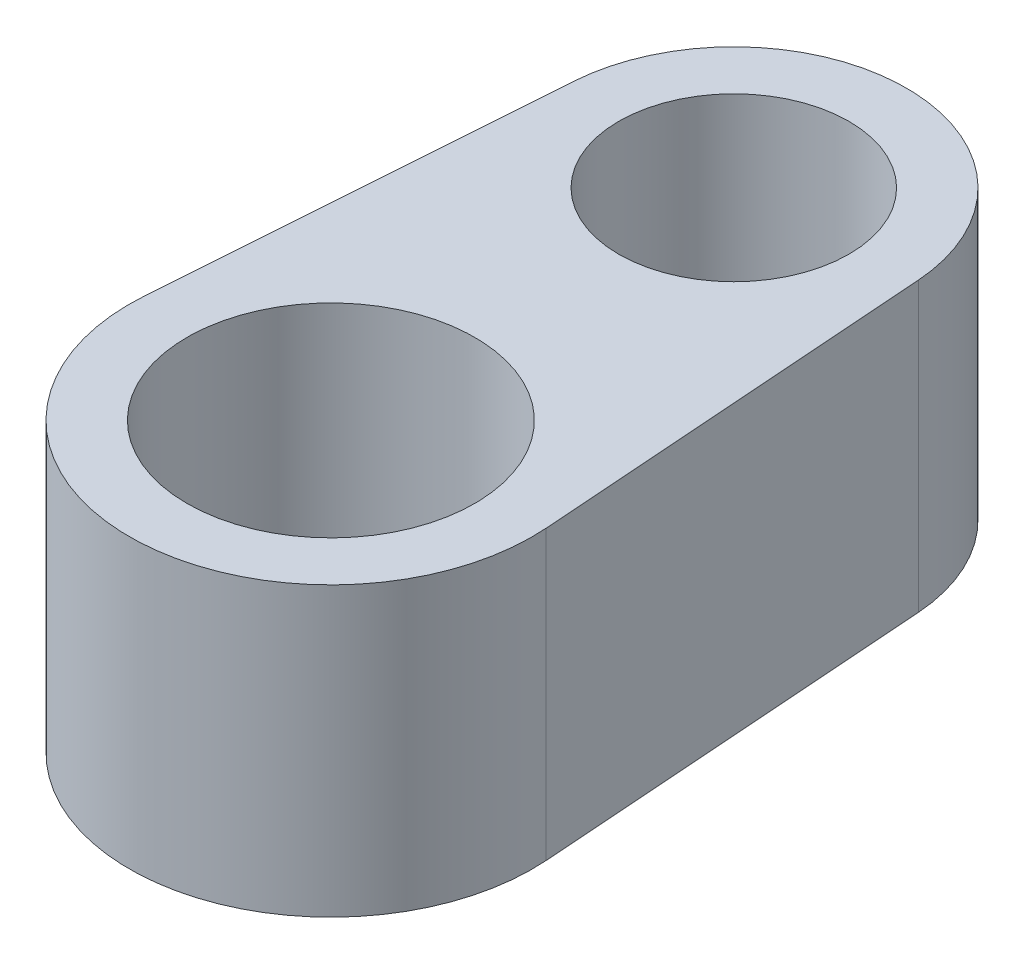
ISO-10303-21;
HEADER;
FILE_DESCRIPTION(('STEP AP214'),'2;1');
FILE_NAME('part.step','',(''),(''),'','','');
FILE_SCHEMA(('AUTOMOTIVE_DESIGN { 1 0 10303 214 1 1 1 1 }'));
ENDSEC;
DATA;
#1=APPLICATION_CONTEXT('core data for automotive mechanical design processes');
#2=APPLICATION_PROTOCOL_DEFINITION('international standard','automotive_design',2000,#1);
#3=PRODUCT_CONTEXT('',#1,'mechanical');
#4=PRODUCT('Part','Part','',(#3));
#5=PRODUCT_RELATED_PRODUCT_CATEGORY('part','',(#4));
#6=PRODUCT_DEFINITION_FORMATION('','',#4);
#7=PRODUCT_DEFINITION_CONTEXT('part definition',#1,'design');
#8=PRODUCT_DEFINITION('design','',#6,#7);
#9=PRODUCT_DEFINITION_SHAPE('','',#8);
#10=(LENGTH_UNIT() NAMED_UNIT(*) SI_UNIT(.MILLI.,.METRE.));
#11=(NAMED_UNIT(*) PLANE_ANGLE_UNIT() SI_UNIT($,.RADIAN.));
#12=(NAMED_UNIT(*) SI_UNIT($,.STERADIAN.) SOLID_ANGLE_UNIT());
#13=UNCERTAINTY_MEASURE_WITH_UNIT(LENGTH_MEASURE(1.E-05),#10,'distance_accuracy_value','');
#14=(GEOMETRIC_REPRESENTATION_CONTEXT(3) GLOBAL_UNCERTAINTY_ASSIGNED_CONTEXT((#13)) GLOBAL_UNIT_ASSIGNED_CONTEXT((#10,
#11,#12)) REPRESENTATION_CONTEXT('',''));
#15=CARTESIAN_POINT('',(0.,0.,0.));
#16=DIRECTION('',(0.,0.,1.));
#17=DIRECTION('',(1.,0.,0.));
#18=AXIS2_PLACEMENT_3D('',#15,#16,#17);
#19=CARTESIAN_POINT('',(0.,6.35,-8.89));
#20=DIRECTION('',(0.,-1.,0.));
#21=DIRECTION('',(0.,0.,-1.));
#22=AXIS2_PLACEMENT_3D('',#19,#20,#21);
#23=CYLINDRICAL_SURFACE('',#22,3.81);
#24=CARTESIAN_POINT('',(0.,0.,-8.89));
#25=DIRECTION('',(0.,1.,0.));
#26=DIRECTION('',(0.,0.,1.));
#27=AXIS2_PLACEMENT_3D('',#24,#25,#26);
#28=CIRCLE('',#27,3.81);
#29=CARTESIAN_POINT('',(3.80026818333998,0.,-9.16214285714285));
#30=VERTEX_POINT('',#29);
#31=CARTESIAN_POINT('',(-3.80026818333998,0.,-9.16214285714285));
#32=VERTEX_POINT('',#31);
#33=EDGE_CURVE('E105',#30,#32,#28,.T.);
#34=ORIENTED_EDGE('',*,*,#33,.T.);
#35=DIRECTION('',(0.,-1.,0.));
#36=VECTOR('',#35,1.);
#37=CARTESIAN_POINT('',(-3.80026818333998,6.35,-9.16214285714285));
#38=LINE('',#37,#36);
#39=CARTESIAN_POINT('',(-3.80026818333998,6.35,-9.16214285714285));
#40=VERTEX_POINT('',#39);
#41=EDGE_CURVE('E11',#40,#32,#38,.T.);
#42=ORIENTED_EDGE('',*,*,#41,.F.);
#43=CARTESIAN_POINT('',(0.,6.35,-8.89));
#44=DIRECTION('',(0.,1.,0.));
#45=DIRECTION('',(0.,0.,1.));
#46=AXIS2_PLACEMENT_3D('',#43,#44,#45);
#47=CIRCLE('',#46,3.81);
#48=CARTESIAN_POINT('',(3.80026818333998,6.35,-9.16214285714285));
#49=VERTEX_POINT('',#48);
#50=EDGE_CURVE('E85',#49,#40,#47,.T.);
#51=ORIENTED_EDGE('',*,*,#50,.F.);
#52=DIRECTION('',(0.,-1.,0.));
#53=VECTOR('',#52,1.);
#54=CARTESIAN_POINT('',(3.80026818333998,6.35,-9.16214285714285));
#55=LINE('',#54,#53);
#56=EDGE_CURVE('E51',#49,#30,#55,.T.);
#57=ORIENTED_EDGE('',*,*,#56,.T.);
#58=EDGE_LOOP('',(#34,#42,#51,#57));
#59=FACE_BOUND('',#58,.T.);
#60=ADVANCED_FACE('F35',(#59),#23,.T.);
#61=CARTESIAN_POINT('',(-4.43364621389664,6.35,-0.317499999999999));
#62=DIRECTION('',(0.997445717412067,0.,0.0714285714285713));
#63=DIRECTION('',(0.0714285714285713,0.,-0.997445717412067));
#64=AXIS2_PLACEMENT_3D('',#61,#62,#63);
#65=PLANE('',#64);
#66=DIRECTION('',(-0.0714285714285713,0.,0.997445717412067));
#67=VECTOR('',#66,1.);
#68=CARTESIAN_POINT('',(-4.43364621389664,0.,-0.317499999999999));
#69=LINE('',#68,#67);
#70=CARTESIAN_POINT('',(-4.43364621389664,0.,-0.3175));
#71=VERTEX_POINT('',#70);
#72=EDGE_CURVE('E90',#32,#71,#69,.T.);
#73=ORIENTED_EDGE('',*,*,#72,.T.);
#74=DIRECTION('',(0.,-1.,0.));
#75=VECTOR('',#74,1.);
#76=CARTESIAN_POINT('',(-4.43364621389664,6.35,-0.3175));
#77=LINE('',#76,#75);
#78=CARTESIAN_POINT('',(-4.43364621389664,6.35,-0.3175));
#79=VERTEX_POINT('',#78);
#80=EDGE_CURVE('E43',#79,#71,#77,.T.);
#81=ORIENTED_EDGE('',*,*,#80,.F.);
#82=DIRECTION('',(-0.0714285714285713,0.,0.997445717412067));
#83=VECTOR('',#82,1.);
#84=CARTESIAN_POINT('',(-4.43364621389664,6.35,-0.317499999999999));
#85=LINE('',#84,#83);
#86=EDGE_CURVE('E77',#40,#79,#85,.T.);
#87=ORIENTED_EDGE('',*,*,#86,.F.);
#88=ORIENTED_EDGE('',*,*,#41,.T.);
#89=EDGE_LOOP('',(#73,#81,#87,#88));
#90=FACE_BOUND('',#89,.T.);
#91=ADVANCED_FACE('F89',(#90),#65,.F.);
#92=CARTESIAN_POINT('',(0.,6.35,0.));
#93=DIRECTION('',(0.,-1.,0.));
#94=DIRECTION('',(0.,0.,-1.));
#95=AXIS2_PLACEMENT_3D('',#92,#93,#94);
#96=CYLINDRICAL_SURFACE('',#95,4.445);
#97=CARTESIAN_POINT('',(0.,0.,0.));
#98=DIRECTION('',(0.,1.,0.));
#99=DIRECTION('',(0.,0.,1.));
#100=AXIS2_PLACEMENT_3D('',#97,#98,#99);
#101=CIRCLE('',#100,4.445);
#102=CARTESIAN_POINT('',(4.43364621389664,0.,-0.3175));
#103=VERTEX_POINT('',#102);
#104=EDGE_CURVE('E108',#71,#103,#101,.T.);
#105=ORIENTED_EDGE('',*,*,#104,.T.);
#106=DIRECTION('',(0.,-1.,0.));
#107=VECTOR('',#106,1.);
#108=CARTESIAN_POINT('',(4.43364621389664,6.35,-0.3175));
#109=LINE('',#108,#107);
#110=CARTESIAN_POINT('',(4.43364621389664,6.35,-0.3175));
#111=VERTEX_POINT('',#110);
#112=EDGE_CURVE('E66',#111,#103,#109,.T.);
#113=ORIENTED_EDGE('',*,*,#112,.F.);
#114=CARTESIAN_POINT('',(0.,6.35,0.));
#115=DIRECTION('',(0.,1.,0.));
#116=DIRECTION('',(0.,0.,1.));
#117=AXIS2_PLACEMENT_3D('',#114,#115,#116);
#118=CIRCLE('',#117,4.445);
#119=EDGE_CURVE('E84',#79,#111,#118,.T.);
#120=ORIENTED_EDGE('',*,*,#119,.F.);
#121=ORIENTED_EDGE('',*,*,#80,.T.);
#122=EDGE_LOOP('',(#105,#113,#120,#121));
#123=FACE_BOUND('',#122,.T.);
#124=ADVANCED_FACE('F93',(#123),#96,.T.);
#125=CARTESIAN_POINT('',(0.,6.35,0.));
#126=DIRECTION('',(0.,-1.,0.));
#127=DIRECTION('',(0.,0.,-1.));
#128=AXIS2_PLACEMENT_3D('',#125,#126,#127);
#129=CYLINDRICAL_SURFACE('',#128,3.175);
#130=CARTESIAN_POINT('',(0.,6.35,0.));
#131=DIRECTION('',(0.,1.,0.));
#132=DIRECTION('',(0.,0.,1.));
#133=AXIS2_PLACEMENT_3D('',#130,#131,#132);
#134=CIRCLE('',#133,3.175);
#135=CARTESIAN_POINT('',(0.,6.35,3.175));
#136=VERTEX_POINT('',#135);
#137=EDGE_CURVE('E96',#136,#136,#134,.T.);
#138=ORIENTED_EDGE('',*,*,#137,.T.);
#139=EDGE_LOOP('',(#138));
#140=FACE_BOUND('',#139,.T.);
#141=CARTESIAN_POINT('',(0.,0.,0.));
#142=DIRECTION('',(0.,1.,0.));
#143=DIRECTION('',(0.,0.,1.));
#144=AXIS2_PLACEMENT_3D('',#141,#142,#143);
#145=CIRCLE('',#144,3.175);
#146=CARTESIAN_POINT('',(0.,0.,3.175));
#147=VERTEX_POINT('',#146);
#148=EDGE_CURVE('E113',#147,#147,#145,.T.);
#149=ORIENTED_EDGE('',*,*,#148,.F.);
#150=EDGE_LOOP('',(#149));
#151=FACE_BOUND('',#150,.T.);
#152=ADVANCED_FACE('F134',(#140,#151),#129,.F.);
#153=CARTESIAN_POINT('',(4.43364621389664,6.35,-0.3175));
#154=DIRECTION('',(0.997445717412067,0.,-0.0714285714285714));
#155=DIRECTION('',(-0.0714285714285714,0.,-0.997445717412067));
#156=AXIS2_PLACEMENT_3D('',#153,#154,#155);
#157=PLANE('',#156);
#158=DIRECTION('',(0.0714285714285714,0.,0.997445717412067));
#159=VECTOR('',#158,1.);
#160=CARTESIAN_POINT('',(4.43364621389664,0.,-0.3175));
#161=LINE('',#160,#159);
#162=EDGE_CURVE('E110',#30,#103,#161,.T.);
#163=ORIENTED_EDGE('',*,*,#162,.F.);
#164=ORIENTED_EDGE('',*,*,#56,.F.);
#165=DIRECTION('',(0.0714285714285714,0.,0.997445717412067));
#166=VECTOR('',#165,1.);
#167=CARTESIAN_POINT('',(4.43364621389664,6.35,-0.3175));
#168=LINE('',#167,#166);
#169=EDGE_CURVE('E94',#49,#111,#168,.T.);
#170=ORIENTED_EDGE('',*,*,#169,.T.);
#171=ORIENTED_EDGE('',*,*,#112,.T.);
#172=EDGE_LOOP('',(#163,#164,#170,#171));
#173=FACE_BOUND('',#172,.T.);
#174=ADVANCED_FACE('F126',(#173),#157,.T.);
#175=CARTESIAN_POINT('',(0.,6.35,-8.89));
#176=DIRECTION('',(0.,-1.,0.));
#177=DIRECTION('',(0.,0.,-1.));
#178=AXIS2_PLACEMENT_3D('',#175,#176,#177);
#179=CYLINDRICAL_SURFACE('',#178,2.54);
#180=CARTESIAN_POINT('',(0.,6.35,-8.89));
#181=DIRECTION('',(0.,1.,0.));
#182=DIRECTION('',(0.,0.,1.));
#183=AXIS2_PLACEMENT_3D('',#180,#181,#182);
#184=CIRCLE('',#183,2.54);
#185=CARTESIAN_POINT('',(0.,6.35,-6.35));
#186=VERTEX_POINT('',#185);
#187=EDGE_CURVE('E102',#186,#186,#184,.T.);
#188=ORIENTED_EDGE('',*,*,#187,.T.);
#189=EDGE_LOOP('',(#188));
#190=FACE_BOUND('',#189,.T.);
#191=CARTESIAN_POINT('',(0.,0.,-8.89));
#192=DIRECTION('',(0.,1.,0.));
#193=DIRECTION('',(0.,0.,1.));
#194=AXIS2_PLACEMENT_3D('',#191,#192,#193);
#195=CIRCLE('',#194,2.54);
#196=CARTESIAN_POINT('',(0.,0.,-6.35));
#197=VERTEX_POINT('',#196);
#198=EDGE_CURVE('E116',#197,#197,#195,.T.);
#199=ORIENTED_EDGE('',*,*,#198,.F.);
#200=EDGE_LOOP('',(#199));
#201=FACE_BOUND('',#200,.T.);
#202=ADVANCED_FACE('F124',(#190,#201),#179,.F.);
#203=CARTESIAN_POINT('',(0.,6.35,0.));
#204=DIRECTION('',(0.,1.,0.));
#205=DIRECTION('',(0.,0.,1.));
#206=AXIS2_PLACEMENT_3D('',#203,#204,#205);
#207=PLANE('',#206);
#208=ORIENTED_EDGE('',*,*,#50,.T.);
#209=ORIENTED_EDGE('',*,*,#86,.T.);
#210=ORIENTED_EDGE('',*,*,#119,.T.);
#211=ORIENTED_EDGE('',*,*,#169,.F.);
#212=EDGE_LOOP('',(#208,#209,#210,#211));
#213=FACE_BOUND('',#212,.T.);
#214=ORIENTED_EDGE('',*,*,#137,.F.);
#215=EDGE_LOOP('',(#214));
#216=FACE_BOUND('',#215,.T.);
#217=ORIENTED_EDGE('',*,*,#187,.F.);
#218=EDGE_LOOP('',(#217));
#219=FACE_BOUND('',#218,.T.);
#220=ADVANCED_FACE('F80',(#213,#216,#219),#207,.T.);
#221=CARTESIAN_POINT('',(0.,0.,0.));
#222=DIRECTION('',(0.,1.,0.));
#223=DIRECTION('',(0.,0.,1.));
#224=AXIS2_PLACEMENT_3D('',#221,#222,#223);
#225=PLANE('',#224);
#226=ORIENTED_EDGE('',*,*,#33,.F.);
#227=ORIENTED_EDGE('',*,*,#162,.T.);
#228=ORIENTED_EDGE('',*,*,#104,.F.);
#229=ORIENTED_EDGE('',*,*,#72,.F.);
#230=EDGE_LOOP('',(#226,#227,#228,#229));
#231=FACE_BOUND('',#230,.T.);
#232=ORIENTED_EDGE('',*,*,#148,.T.);
#233=EDGE_LOOP('',(#232));
#234=FACE_BOUND('',#233,.T.);
#235=ORIENTED_EDGE('',*,*,#198,.T.);
#236=EDGE_LOOP('',(#235));
#237=FACE_BOUND('',#236,.T.);
#238=ADVANCED_FACE('F122',(#231,#234,#237),#225,.F.);
#239=CLOSED_SHELL('',(#60,#91,#124,#152,#174,#202,#220,#238));
#240=MANIFOLD_SOLID_BREP('B2',#239);
#241=ADVANCED_BREP_SHAPE_REPRESENTATION('',(#18,#240),#14);
#242=SHAPE_DEFINITION_REPRESENTATION(#9,#241);
ENDSEC;
END-ISO-10303-21;
